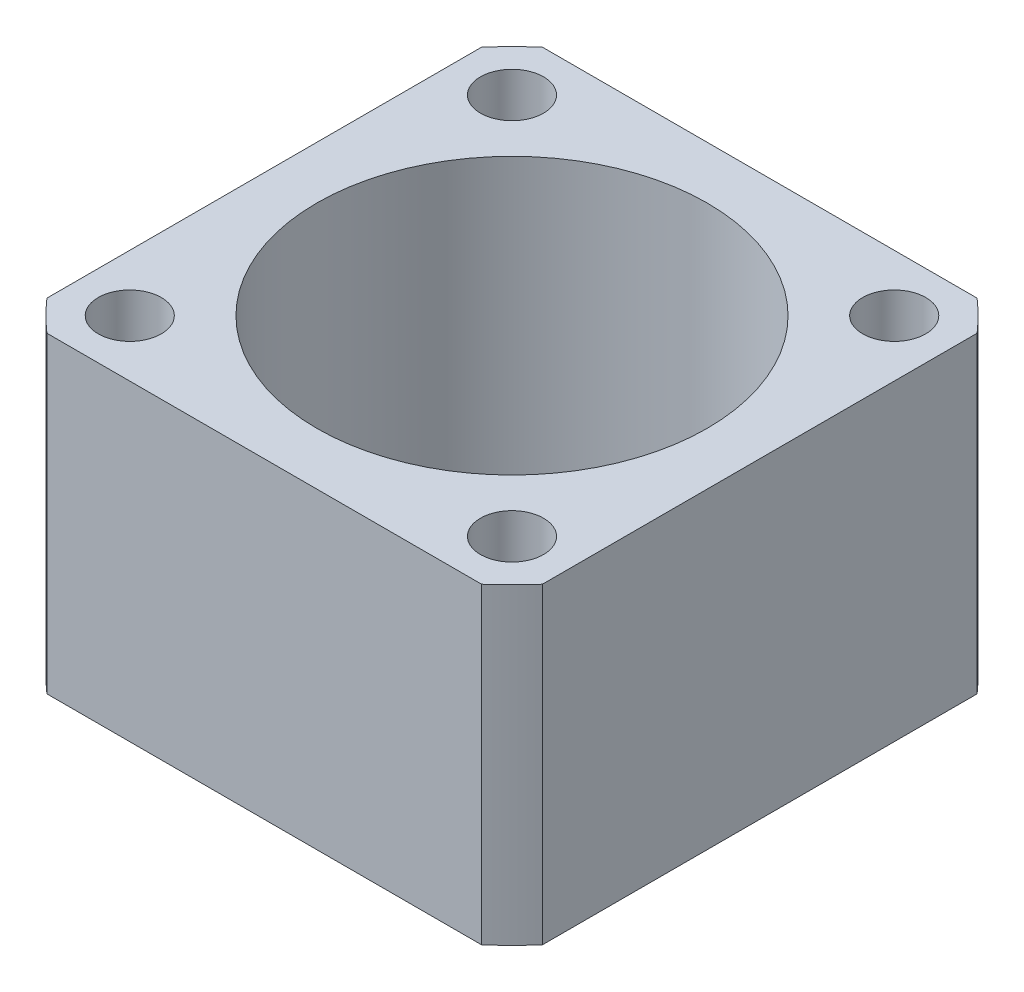
ISO-10303-21;
HEADER;
FILE_DESCRIPTION(('STEP AP214'),'2;1');
FILE_NAME('part.step','',(''),(''),'','','');
FILE_SCHEMA(('AUTOMOTIVE_DESIGN { 1 0 10303 214 1 1 1 1 }'));
ENDSEC;
DATA;
#1=APPLICATION_CONTEXT('core data for automotive mechanical design processes');
#2=APPLICATION_PROTOCOL_DEFINITION('international standard','automotive_design',2000,#1);
#3=PRODUCT_CONTEXT('',#1,'mechanical');
#4=PRODUCT('Part','Part','',(#3));
#5=PRODUCT_RELATED_PRODUCT_CATEGORY('part','',(#4));
#6=PRODUCT_DEFINITION_FORMATION('','',#4);
#7=PRODUCT_DEFINITION_CONTEXT('part definition',#1,'design');
#8=PRODUCT_DEFINITION('design','',#6,#7);
#9=PRODUCT_DEFINITION_SHAPE('','',#8);
#10=(LENGTH_UNIT() NAMED_UNIT(*) SI_UNIT(.MILLI.,.METRE.));
#11=(NAMED_UNIT(*) PLANE_ANGLE_UNIT() SI_UNIT($,.RADIAN.));
#12=(NAMED_UNIT(*) SI_UNIT($,.STERADIAN.) SOLID_ANGLE_UNIT());
#13=UNCERTAINTY_MEASURE_WITH_UNIT(LENGTH_MEASURE(1.E-05),#10,'distance_accuracy_value','');
#14=(GEOMETRIC_REPRESENTATION_CONTEXT(3) GLOBAL_UNCERTAINTY_ASSIGNED_CONTEXT((#13)) GLOBAL_UNIT_ASSIGNED_CONTEXT((#10,
#11,#12)) REPRESENTATION_CONTEXT('',''));
#15=CARTESIAN_POINT('',(0.,0.,0.));
#16=DIRECTION('',(0.,0.,1.));
#17=DIRECTION('',(1.,0.,0.));
#18=AXIS2_PLACEMENT_3D('',#15,#16,#17);
#19=CARTESIAN_POINT('',(0.,10.4,0.));
#20=DIRECTION('',(0.,1.,0.));
#21=DIRECTION('',(1.,0.,0.));
#22=AXIS2_PLACEMENT_3D('',#19,#20,#21);
#23=PLANE('',#22);
#24=CARTESIAN_POINT('',(0.,10.4,0.));
#25=DIRECTION('',(0.,-1.,0.));
#26=DIRECTION('',(1.,0.,0.));
#27=AXIS2_PLACEMENT_3D('',#24,#25,#26);
#28=CIRCLE('',#27,6.5);
#29=CARTESIAN_POINT('',(-6.5,10.4,0.));
#30=VERTEX_POINT('',#29);
#31=EDGE_CURVE('E242',#30,#30,#28,.T.);
#32=ORIENTED_EDGE('',*,*,#31,.T.);
#33=EDGE_LOOP('',(#32));
#34=FACE_BOUND('',#33,.T.);
#35=CARTESIAN_POINT('',(-6.36396103067893,10.4,-6.36396103067893));
#36=DIRECTION('',(0.,-1.,0.));
#37=DIRECTION('',(1.,0.,0.));
#38=AXIS2_PLACEMENT_3D('',#35,#36,#37);
#39=CIRCLE('',#38,1.05);
#40=CARTESIAN_POINT('',(-7.41396103067893,10.4,-6.36396103067893));
#41=VERTEX_POINT('',#40);
#42=EDGE_CURVE('E437',#41,#41,#39,.T.);
#43=ORIENTED_EDGE('',*,*,#42,.T.);
#44=EDGE_LOOP('',(#43));
#45=FACE_BOUND('',#44,.T.);
#46=CARTESIAN_POINT('',(6.36396103067893,10.4,-6.36396103067893));
#47=DIRECTION('',(0.,-1.,0.));
#48=DIRECTION('',(1.,0.,0.));
#49=AXIS2_PLACEMENT_3D('',#46,#47,#48);
#50=CIRCLE('',#49,1.05);
#51=CARTESIAN_POINT('',(5.31396103067893,10.4,-6.36396103067893));
#52=VERTEX_POINT('',#51);
#53=EDGE_CURVE('E206',#52,#52,#50,.T.);
#54=ORIENTED_EDGE('',*,*,#53,.T.);
#55=EDGE_LOOP('',(#54));
#56=FACE_BOUND('',#55,.T.);
#57=CARTESIAN_POINT('',(-6.36396103067893,10.4,6.36396103067893));
#58=DIRECTION('',(0.,-1.,0.));
#59=DIRECTION('',(1.,0.,0.));
#60=AXIS2_PLACEMENT_3D('',#57,#58,#59);
#61=CIRCLE('',#60,1.05);
#62=CARTESIAN_POINT('',(-7.41396103067893,10.4,6.36396103067893));
#63=VERTEX_POINT('',#62);
#64=EDGE_CURVE('E254',#63,#63,#61,.T.);
#65=ORIENTED_EDGE('',*,*,#64,.T.);
#66=EDGE_LOOP('',(#65));
#67=FACE_BOUND('',#66,.T.);
#68=CARTESIAN_POINT('',(6.36396103067893,10.4,6.36396103067893));
#69=DIRECTION('',(0.,-1.,0.));
#70=DIRECTION('',(1.,0.,0.));
#71=AXIS2_PLACEMENT_3D('',#68,#69,#70);
#72=CIRCLE('',#71,1.05);
#73=CARTESIAN_POINT('',(5.31396103067893,10.4,6.36396103067893));
#74=VERTEX_POINT('',#73);
#75=EDGE_CURVE('E26',#74,#74,#72,.T.);
#76=ORIENTED_EDGE('',*,*,#75,.T.);
#77=EDGE_LOOP('',(#76));
#78=FACE_BOUND('',#77,.T.);
#79=DIRECTION('',(0.,0.,-1.));
#80=VECTOR('',#79,1.);
#81=CARTESIAN_POINT('',(8.25,10.4,-3.61898207373289));
#82=LINE('',#81,#80);
#83=CARTESIAN_POINT('',(8.25,10.4,7.23796414746578));
#84=VERTEX_POINT('',#83);
#85=CARTESIAN_POINT('',(8.25,10.4,-7.23796414746578));
#86=VERTEX_POINT('',#85);
#87=EDGE_CURVE('E233',#84,#86,#82,.T.);
#88=ORIENTED_EDGE('',*,*,#87,.T.);
#89=CARTESIAN_POINT('',(0.,10.4,0.));
#90=DIRECTION('',(0.,1.,0.));
#91=DIRECTION('',(1.,0.,0.));
#92=AXIS2_PLACEMENT_3D('',#89,#90,#91);
#93=CIRCLE('',#92,10.975);
#94=CARTESIAN_POINT('',(7.23796414746578,10.4,-8.25));
#95=VERTEX_POINT('',#94);
#96=EDGE_CURVE('E247',#86,#95,#93,.T.);
#97=ORIENTED_EDGE('',*,*,#96,.T.);
#98=DIRECTION('',(-1.,0.,0.));
#99=VECTOR('',#98,1.);
#100=CARTESIAN_POINT('',(-3.61898207373289,10.4,-8.25));
#101=LINE('',#100,#99);
#102=CARTESIAN_POINT('',(-7.23796414746578,10.4,-8.25));
#103=VERTEX_POINT('',#102);
#104=EDGE_CURVE('E263',#95,#103,#101,.T.);
#105=ORIENTED_EDGE('',*,*,#104,.T.);
#106=CARTESIAN_POINT('',(0.,10.4,0.));
#107=DIRECTION('',(0.,1.,0.));
#108=DIRECTION('',(1.,0.,0.));
#109=AXIS2_PLACEMENT_3D('',#106,#107,#108);
#110=CIRCLE('',#109,10.975);
#111=CARTESIAN_POINT('',(-8.25,10.4,-7.23796414746578));
#112=VERTEX_POINT('',#111);
#113=EDGE_CURVE('E269',#103,#112,#110,.T.);
#114=ORIENTED_EDGE('',*,*,#113,.T.);
#115=DIRECTION('',(0.,0.,1.));
#116=VECTOR('',#115,1.);
#117=CARTESIAN_POINT('',(-8.25,10.4,3.61898207373289));
#118=LINE('',#117,#116);
#119=CARTESIAN_POINT('',(-8.25,10.4,7.23796414746578));
#120=VERTEX_POINT('',#119);
#121=EDGE_CURVE('E241',#112,#120,#118,.T.);
#122=ORIENTED_EDGE('',*,*,#121,.T.);
#123=CARTESIAN_POINT('',(0.,10.4,0.));
#124=DIRECTION('',(0.,1.,0.));
#125=DIRECTION('',(1.,0.,0.));
#126=AXIS2_PLACEMENT_3D('',#123,#124,#125);
#127=CIRCLE('',#126,10.975);
#128=CARTESIAN_POINT('',(-7.23796414746578,10.4,8.25));
#129=VERTEX_POINT('',#128);
#130=EDGE_CURVE('E191',#120,#129,#127,.T.);
#131=ORIENTED_EDGE('',*,*,#130,.T.);
#132=DIRECTION('',(1.,0.,0.));
#133=VECTOR('',#132,1.);
#134=CARTESIAN_POINT('',(3.61898207373289,10.4,8.25));
#135=LINE('',#134,#133);
#136=CARTESIAN_POINT('',(7.23796414746578,10.4,8.25));
#137=VERTEX_POINT('',#136);
#138=EDGE_CURVE('E173',#129,#137,#135,.T.);
#139=ORIENTED_EDGE('',*,*,#138,.T.);
#140=CARTESIAN_POINT('',(0.,10.4,0.));
#141=DIRECTION('',(0.,1.,0.));
#142=DIRECTION('',(1.,0.,0.));
#143=AXIS2_PLACEMENT_3D('',#140,#141,#142);
#144=CIRCLE('',#143,10.975);
#145=EDGE_CURVE('E157',#137,#84,#144,.T.);
#146=ORIENTED_EDGE('',*,*,#145,.T.);
#147=EDGE_LOOP('',(#88,#97,#105,#114,#122,#131,#139,#146));
#148=FACE_BOUND('',#147,.T.);
#149=ADVANCED_FACE('F16',(#34,#45,#56,#67,#78,#148),#23,.T.);
#150=CARTESIAN_POINT('',(6.36396103067893,0.,6.36396103067893));
#151=DIRECTION('',(0.,1.,0.));
#152=DIRECTION('',(1.,0.,0.));
#153=AXIS2_PLACEMENT_3D('',#150,#151,#152);
#154=CYLINDRICAL_SURFACE('',#153,1.05);
#155=ORIENTED_EDGE('',*,*,#75,.F.);
#156=DIRECTION('',(0.,-1.,0.));
#157=VECTOR('',#156,1.);
#158=CARTESIAN_POINT('',(5.31396103067893,0.,6.36396103067893));
#159=LINE('',#158,#157);
#160=CARTESIAN_POINT('',(5.31396103067893,0.,6.36396103067893));
#161=VERTEX_POINT('',#160);
#162=EDGE_CURVE('E11',#74,#161,#159,.T.);
#163=ORIENTED_EDGE('',*,*,#162,.T.);
#164=CARTESIAN_POINT('',(6.36396103067893,0.,6.36396103067893));
#165=DIRECTION('',(0.,-1.,0.));
#166=DIRECTION('',(1.,0.,0.));
#167=AXIS2_PLACEMENT_3D('',#164,#165,#166);
#168=CIRCLE('',#167,1.05);
#169=EDGE_CURVE('E183',#161,#161,#168,.T.);
#170=ORIENTED_EDGE('',*,*,#169,.T.);
#171=ORIENTED_EDGE('',*,*,#162,.F.);
#172=EDGE_LOOP('',(#155,#163,#170,#171));
#173=FACE_BOUND('',#172,.T.);
#174=ADVANCED_FACE('F299',(#173),#154,.F.);
#175=CARTESIAN_POINT('',(-6.36396103067893,0.,6.36396103067893));
#176=DIRECTION('',(0.,1.,0.));
#177=DIRECTION('',(1.,0.,0.));
#178=AXIS2_PLACEMENT_3D('',#175,#176,#177);
#179=CYLINDRICAL_SURFACE('',#178,1.05);
#180=ORIENTED_EDGE('',*,*,#64,.F.);
#181=DIRECTION('',(0.,-1.,0.));
#182=VECTOR('',#181,1.);
#183=CARTESIAN_POINT('',(-7.41396103067893,0.,6.36396103067893));
#184=LINE('',#183,#182);
#185=CARTESIAN_POINT('',(-7.41396103067893,0.,6.36396103067893));
#186=VERTEX_POINT('',#185);
#187=EDGE_CURVE('E179',#63,#186,#184,.T.);
#188=ORIENTED_EDGE('',*,*,#187,.T.);
#189=CARTESIAN_POINT('',(-6.36396103067893,0.,6.36396103067893));
#190=DIRECTION('',(0.,-1.,0.));
#191=DIRECTION('',(1.,0.,0.));
#192=AXIS2_PLACEMENT_3D('',#189,#190,#191);
#193=CIRCLE('',#192,1.05);
#194=EDGE_CURVE('E180',#186,#186,#193,.T.);
#195=ORIENTED_EDGE('',*,*,#194,.T.);
#196=ORIENTED_EDGE('',*,*,#187,.F.);
#197=EDGE_LOOP('',(#180,#188,#195,#196));
#198=FACE_BOUND('',#197,.T.);
#199=ADVANCED_FACE('F344',(#198),#179,.F.);
#200=CARTESIAN_POINT('',(6.36396103067893,0.,-6.36396103067893));
#201=DIRECTION('',(0.,1.,0.));
#202=DIRECTION('',(1.,0.,0.));
#203=AXIS2_PLACEMENT_3D('',#200,#201,#202);
#204=CYLINDRICAL_SURFACE('',#203,1.05);
#205=ORIENTED_EDGE('',*,*,#53,.F.);
#206=DIRECTION('',(0.,-1.,0.));
#207=VECTOR('',#206,1.);
#208=CARTESIAN_POINT('',(5.31396103067893,0.,-6.36396103067893));
#209=LINE('',#208,#207);
#210=CARTESIAN_POINT('',(5.31396103067893,0.,-6.36396103067893));
#211=VERTEX_POINT('',#210);
#212=EDGE_CURVE('E120',#52,#211,#209,.T.);
#213=ORIENTED_EDGE('',*,*,#212,.T.);
#214=CARTESIAN_POINT('',(6.36396103067893,0.,-6.36396103067893));
#215=DIRECTION('',(0.,-1.,0.));
#216=DIRECTION('',(1.,0.,0.));
#217=AXIS2_PLACEMENT_3D('',#214,#215,#216);
#218=CIRCLE('',#217,1.05);
#219=EDGE_CURVE('E184',#211,#211,#218,.T.);
#220=ORIENTED_EDGE('',*,*,#219,.T.);
#221=ORIENTED_EDGE('',*,*,#212,.F.);
#222=EDGE_LOOP('',(#205,#213,#220,#221));
#223=FACE_BOUND('',#222,.T.);
#224=ADVANCED_FACE('F326',(#223),#204,.F.);
#225=CARTESIAN_POINT('',(-6.36396103067893,0.,-6.36396103067893));
#226=DIRECTION('',(0.,1.,0.));
#227=DIRECTION('',(1.,0.,0.));
#228=AXIS2_PLACEMENT_3D('',#225,#226,#227);
#229=CYLINDRICAL_SURFACE('',#228,1.05);
#230=ORIENTED_EDGE('',*,*,#42,.F.);
#231=DIRECTION('',(0.,-1.,0.));
#232=VECTOR('',#231,1.);
#233=CARTESIAN_POINT('',(-7.41396103067893,0.,-6.36396103067893));
#234=LINE('',#233,#232);
#235=CARTESIAN_POINT('',(-7.41396103067893,0.,-6.36396103067893));
#236=VERTEX_POINT('',#235);
#237=EDGE_CURVE('E109',#41,#236,#234,.T.);
#238=ORIENTED_EDGE('',*,*,#237,.T.);
#239=CARTESIAN_POINT('',(-6.36396103067893,0.,-6.36396103067893));
#240=DIRECTION('',(0.,-1.,0.));
#241=DIRECTION('',(1.,0.,0.));
#242=AXIS2_PLACEMENT_3D('',#239,#240,#241);
#243=CIRCLE('',#242,1.05);
#244=EDGE_CURVE('E19',#236,#236,#243,.T.);
#245=ORIENTED_EDGE('',*,*,#244,.T.);
#246=ORIENTED_EDGE('',*,*,#237,.F.);
#247=EDGE_LOOP('',(#230,#238,#245,#246));
#248=FACE_BOUND('',#247,.T.);
#249=ADVANCED_FACE('F320',(#248),#229,.F.);
#250=CARTESIAN_POINT('',(0.,0.,0.));
#251=DIRECTION('',(0.,1.,0.));
#252=DIRECTION('',(1.,0.,0.));
#253=AXIS2_PLACEMENT_3D('',#250,#251,#252);
#254=CYLINDRICAL_SURFACE('',#253,6.5);
#255=ORIENTED_EDGE('',*,*,#31,.F.);
#256=DIRECTION('',(0.,-1.,0.));
#257=VECTOR('',#256,1.);
#258=CARTESIAN_POINT('',(-6.5,0.,0.));
#259=LINE('',#258,#257);
#260=CARTESIAN_POINT('',(-6.5,0.,0.));
#261=VERTEX_POINT('',#260);
#262=EDGE_CURVE('E246',#30,#261,#259,.T.);
#263=ORIENTED_EDGE('',*,*,#262,.T.);
#264=CARTESIAN_POINT('',(0.,0.,0.));
#265=DIRECTION('',(0.,-1.,0.));
#266=DIRECTION('',(1.,0.,0.));
#267=AXIS2_PLACEMENT_3D('',#264,#265,#266);
#268=CIRCLE('',#267,6.5);
#269=EDGE_CURVE('E198',#261,#261,#268,.T.);
#270=ORIENTED_EDGE('',*,*,#269,.T.);
#271=ORIENTED_EDGE('',*,*,#262,.F.);
#272=EDGE_LOOP('',(#255,#263,#270,#271));
#273=FACE_BOUND('',#272,.T.);
#274=ADVANCED_FACE('F325',(#273),#254,.F.);
#275=CARTESIAN_POINT('',(0.,0.,0.));
#276=DIRECTION('',(0.,1.,0.));
#277=DIRECTION('',(1.,0.,0.));
#278=AXIS2_PLACEMENT_3D('',#275,#276,#277);
#279=CYLINDRICAL_SURFACE('',#278,10.975);
#280=DIRECTION('',(0.,-1.,0.));
#281=VECTOR('',#280,1.);
#282=CARTESIAN_POINT('',(8.25,0.,-7.23796414746578));
#283=LINE('',#282,#281);
#284=CARTESIAN_POINT('',(8.25,0.,-7.23796414746578));
#285=VERTEX_POINT('',#284);
#286=EDGE_CURVE('E259',#86,#285,#283,.T.);
#287=ORIENTED_EDGE('',*,*,#286,.T.);
#288=CARTESIAN_POINT('',(0.,0.,0.));
#289=DIRECTION('',(0.,1.,0.));
#290=DIRECTION('',(1.,0.,0.));
#291=AXIS2_PLACEMENT_3D('',#288,#289,#290);
#292=CIRCLE('',#291,10.975);
#293=CARTESIAN_POINT('',(7.23796414746578,0.,-8.25));
#294=VERTEX_POINT('',#293);
#295=EDGE_CURVE('E205',#285,#294,#292,.T.);
#296=ORIENTED_EDGE('',*,*,#295,.T.);
#297=DIRECTION('',(0.,1.,0.));
#298=VECTOR('',#297,1.);
#299=CARTESIAN_POINT('',(7.23796414746578,0.,-8.25));
#300=LINE('',#299,#298);
#301=EDGE_CURVE('E213',#294,#95,#300,.T.);
#302=ORIENTED_EDGE('',*,*,#301,.T.);
#303=ORIENTED_EDGE('',*,*,#96,.F.);
#304=EDGE_LOOP('',(#287,#296,#302,#303));
#305=FACE_BOUND('',#304,.T.);
#306=ADVANCED_FACE('F331',(#305),#279,.T.);
#307=CARTESIAN_POINT('',(0.,0.,0.));
#308=DIRECTION('',(0.,1.,0.));
#309=DIRECTION('',(1.,0.,0.));
#310=AXIS2_PLACEMENT_3D('',#307,#308,#309);
#311=CYLINDRICAL_SURFACE('',#310,10.975);
#312=DIRECTION('',(0.,1.,0.));
#313=VECTOR('',#312,1.);
#314=CARTESIAN_POINT('',(8.25,0.,7.23796414746578));
#315=LINE('',#314,#313);
#316=CARTESIAN_POINT('',(8.25,0.,7.23796414746578));
#317=VERTEX_POINT('',#316);
#318=EDGE_CURVE('E237',#317,#84,#315,.T.);
#319=ORIENTED_EDGE('',*,*,#318,.T.);
#320=ORIENTED_EDGE('',*,*,#145,.F.);
#321=DIRECTION('',(0.,-1.,0.));
#322=VECTOR('',#321,1.);
#323=CARTESIAN_POINT('',(7.23796414746578,0.,8.25));
#324=LINE('',#323,#322);
#325=CARTESIAN_POINT('',(7.23796414746578,0.,8.25));
#326=VERTEX_POINT('',#325);
#327=EDGE_CURVE('E154',#137,#326,#324,.T.);
#328=ORIENTED_EDGE('',*,*,#327,.T.);
#329=CARTESIAN_POINT('',(0.,0.,0.));
#330=DIRECTION('',(0.,1.,0.));
#331=DIRECTION('',(1.,0.,0.));
#332=AXIS2_PLACEMENT_3D('',#329,#330,#331);
#333=CIRCLE('',#332,10.975);
#334=EDGE_CURVE('E138',#326,#317,#333,.T.);
#335=ORIENTED_EDGE('',*,*,#334,.T.);
#336=EDGE_LOOP('',(#319,#320,#328,#335));
#337=FACE_BOUND('',#336,.T.);
#338=ADVANCED_FACE('F155',(#337),#311,.T.);
#339=CARTESIAN_POINT('',(0.,0.,0.));
#340=DIRECTION('',(0.,1.,0.));
#341=DIRECTION('',(1.,0.,0.));
#342=AXIS2_PLACEMENT_3D('',#339,#340,#341);
#343=CYLINDRICAL_SURFACE('',#342,10.975);
#344=DIRECTION('',(0.,-1.,0.));
#345=VECTOR('',#344,1.);
#346=CARTESIAN_POINT('',(-7.23796414746578,0.,-8.25));
#347=LINE('',#346,#345);
#348=CARTESIAN_POINT('',(-7.23796414746578,0.,-8.25));
#349=VERTEX_POINT('',#348);
#350=EDGE_CURVE('E212',#103,#349,#347,.T.);
#351=ORIENTED_EDGE('',*,*,#350,.T.);
#352=CARTESIAN_POINT('',(0.,0.,0.));
#353=DIRECTION('',(0.,1.,0.));
#354=DIRECTION('',(1.,0.,0.));
#355=AXIS2_PLACEMENT_3D('',#352,#353,#354);
#356=CIRCLE('',#355,10.975);
#357=CARTESIAN_POINT('',(-8.25,0.,-7.23796414746578));
#358=VERTEX_POINT('',#357);
#359=EDGE_CURVE('E201',#349,#358,#356,.T.);
#360=ORIENTED_EDGE('',*,*,#359,.T.);
#361=DIRECTION('',(0.,1.,0.));
#362=VECTOR('',#361,1.);
#363=CARTESIAN_POINT('',(-8.25,0.,-7.23796414746578));
#364=LINE('',#363,#362);
#365=EDGE_CURVE('E151',#358,#112,#364,.T.);
#366=ORIENTED_EDGE('',*,*,#365,.T.);
#367=ORIENTED_EDGE('',*,*,#113,.F.);
#368=EDGE_LOOP('',(#351,#360,#366,#367));
#369=FACE_BOUND('',#368,.T.);
#370=ADVANCED_FACE('F289',(#369),#343,.T.);
#371=CARTESIAN_POINT('',(0.,0.,0.));
#372=DIRECTION('',(0.,1.,0.));
#373=DIRECTION('',(1.,0.,0.));
#374=AXIS2_PLACEMENT_3D('',#371,#372,#373);
#375=CYLINDRICAL_SURFACE('',#374,10.975);
#376=DIRECTION('',(0.,1.,0.));
#377=VECTOR('',#376,1.);
#378=CARTESIAN_POINT('',(-7.23796414746578,0.,8.25));
#379=LINE('',#378,#377);
#380=CARTESIAN_POINT('',(-7.23796414746578,0.,8.25));
#381=VERTEX_POINT('',#380);
#382=EDGE_CURVE('E166',#381,#129,#379,.T.);
#383=ORIENTED_EDGE('',*,*,#382,.T.);
#384=ORIENTED_EDGE('',*,*,#130,.F.);
#385=DIRECTION('',(0.,-1.,0.));
#386=VECTOR('',#385,1.);
#387=CARTESIAN_POINT('',(-8.25,0.,7.23796414746578));
#388=LINE('',#387,#386);
#389=CARTESIAN_POINT('',(-8.25,0.,7.23796414746578));
#390=VERTEX_POINT('',#389);
#391=EDGE_CURVE('E251',#120,#390,#388,.T.);
#392=ORIENTED_EDGE('',*,*,#391,.T.);
#393=CARTESIAN_POINT('',(0.,0.,0.));
#394=DIRECTION('',(0.,1.,0.));
#395=DIRECTION('',(1.,0.,0.));
#396=AXIS2_PLACEMENT_3D('',#393,#394,#395);
#397=CIRCLE('',#396,10.975);
#398=EDGE_CURVE('E150',#390,#381,#397,.T.);
#399=ORIENTED_EDGE('',*,*,#398,.T.);
#400=EDGE_LOOP('',(#383,#384,#392,#399));
#401=FACE_BOUND('',#400,.T.);
#402=ADVANCED_FACE('F385',(#401),#375,.T.);
#403=CARTESIAN_POINT('',(0.,0.,0.));
#404=DIRECTION('',(0.,1.,0.));
#405=DIRECTION('',(1.,0.,0.));
#406=AXIS2_PLACEMENT_3D('',#403,#404,#405);
#407=PLANE('',#406);
#408=ORIENTED_EDGE('',*,*,#169,.F.);
#409=EDGE_LOOP('',(#408));
#410=FACE_BOUND('',#409,.T.);
#411=ORIENTED_EDGE('',*,*,#194,.F.);
#412=EDGE_LOOP('',(#411));
#413=FACE_BOUND('',#412,.T.);
#414=ORIENTED_EDGE('',*,*,#219,.F.);
#415=EDGE_LOOP('',(#414));
#416=FACE_BOUND('',#415,.T.);
#417=ORIENTED_EDGE('',*,*,#244,.F.);
#418=EDGE_LOOP('',(#417));
#419=FACE_BOUND('',#418,.T.);
#420=ORIENTED_EDGE('',*,*,#269,.F.);
#421=EDGE_LOOP('',(#420));
#422=FACE_BOUND('',#421,.T.);
#423=DIRECTION('',(0.,0.,1.));
#424=VECTOR('',#423,1.);
#425=CARTESIAN_POINT('',(8.25,0.,-3.61898207373289));
#426=LINE('',#425,#424);
#427=EDGE_CURVE('E145',#285,#317,#426,.T.);
#428=ORIENTED_EDGE('',*,*,#427,.T.);
#429=ORIENTED_EDGE('',*,*,#334,.F.);
#430=DIRECTION('',(-1.,0.,0.));
#431=VECTOR('',#430,1.);
#432=CARTESIAN_POINT('',(3.61898207373289,0.,8.25));
#433=LINE('',#432,#431);
#434=EDGE_CURVE('E142',#326,#381,#433,.T.);
#435=ORIENTED_EDGE('',*,*,#434,.T.);
#436=ORIENTED_EDGE('',*,*,#398,.F.);
#437=DIRECTION('',(0.,0.,-1.));
#438=VECTOR('',#437,1.);
#439=CARTESIAN_POINT('',(-8.25,0.,3.61898207373289));
#440=LINE('',#439,#438);
#441=EDGE_CURVE('E162',#390,#358,#440,.T.);
#442=ORIENTED_EDGE('',*,*,#441,.T.);
#443=ORIENTED_EDGE('',*,*,#359,.F.);
#444=DIRECTION('',(1.,0.,0.));
#445=VECTOR('',#444,1.);
#446=CARTESIAN_POINT('',(-3.61898207373289,0.,-8.25));
#447=LINE('',#446,#445);
#448=EDGE_CURVE('E209',#349,#294,#447,.T.);
#449=ORIENTED_EDGE('',*,*,#448,.T.);
#450=ORIENTED_EDGE('',*,*,#295,.F.);
#451=EDGE_LOOP('',(#428,#429,#435,#436,#442,#443,#449,#450));
#452=FACE_BOUND('',#451,.T.);
#453=ADVANCED_FACE('F140',(#410,#413,#416,#419,#422,#452),#407,.F.);
#454=CARTESIAN_POINT('',(-8.25,-2.5,7.23796414746577));
#455=DIRECTION('',(1.,0.,0.));
#456=DIRECTION('',(0.,1.,0.));
#457=AXIS2_PLACEMENT_3D('',#454,#455,#456);
#458=PLANE('',#457);
#459=ORIENTED_EDGE('',*,*,#441,.F.);
#460=ORIENTED_EDGE('',*,*,#391,.F.);
#461=ORIENTED_EDGE('',*,*,#121,.F.);
#462=ORIENTED_EDGE('',*,*,#365,.F.);
#463=EDGE_LOOP('',(#459,#460,#461,#462));
#464=FACE_BOUND('',#463,.T.);
#465=ADVANCED_FACE('F287',(#464),#458,.F.);
#466=CARTESIAN_POINT('',(7.23796414746577,-2.5,8.25));
#467=DIRECTION('',(0.,0.,-1.));
#468=DIRECTION('',(0.,-1.,0.));
#469=AXIS2_PLACEMENT_3D('',#466,#467,#468);
#470=PLANE('',#469);
#471=ORIENTED_EDGE('',*,*,#138,.F.);
#472=ORIENTED_EDGE('',*,*,#382,.F.);
#473=ORIENTED_EDGE('',*,*,#434,.F.);
#474=ORIENTED_EDGE('',*,*,#327,.F.);
#475=EDGE_LOOP('',(#471,#472,#473,#474));
#476=FACE_BOUND('',#475,.T.);
#477=ADVANCED_FACE('F164',(#476),#470,.F.);
#478=CARTESIAN_POINT('',(-7.23796414746578,-2.5,-8.25));
#479=DIRECTION('',(0.,0.,1.));
#480=DIRECTION('',(1.,0.,0.));
#481=AXIS2_PLACEMENT_3D('',#478,#479,#480);
#482=PLANE('',#481);
#483=ORIENTED_EDGE('',*,*,#104,.F.);
#484=ORIENTED_EDGE('',*,*,#301,.F.);
#485=ORIENTED_EDGE('',*,*,#448,.F.);
#486=ORIENTED_EDGE('',*,*,#350,.F.);
#487=EDGE_LOOP('',(#483,#484,#485,#486));
#488=FACE_BOUND('',#487,.T.);
#489=ADVANCED_FACE('F380',(#488),#482,.F.);
#490=CARTESIAN_POINT('',(8.25,-2.5,-7.23796414746577));
#491=DIRECTION('',(-1.,0.,0.));
#492=DIRECTION('',(0.,0.,1.));
#493=AXIS2_PLACEMENT_3D('',#490,#491,#492);
#494=PLANE('',#493);
#495=ORIENTED_EDGE('',*,*,#87,.F.);
#496=ORIENTED_EDGE('',*,*,#318,.F.);
#497=ORIENTED_EDGE('',*,*,#427,.F.);
#498=ORIENTED_EDGE('',*,*,#286,.F.);
#499=EDGE_LOOP('',(#495,#496,#497,#498));
#500=FACE_BOUND('',#499,.T.);
#501=ADVANCED_FACE('F308',(#500),#494,.F.);
#502=CLOSED_SHELL('',(#149,#174,#199,#224,#249,#274,#306,#338,#370,#402,#453,#465,#477,#489,#501));
#503=MANIFOLD_SOLID_BREP('B1',#502);
#504=ADVANCED_BREP_SHAPE_REPRESENTATION('',(#18,#503),#14);
#505=SHAPE_DEFINITION_REPRESENTATION(#9,#504);
ENDSEC;
END-ISO-10303-21;
